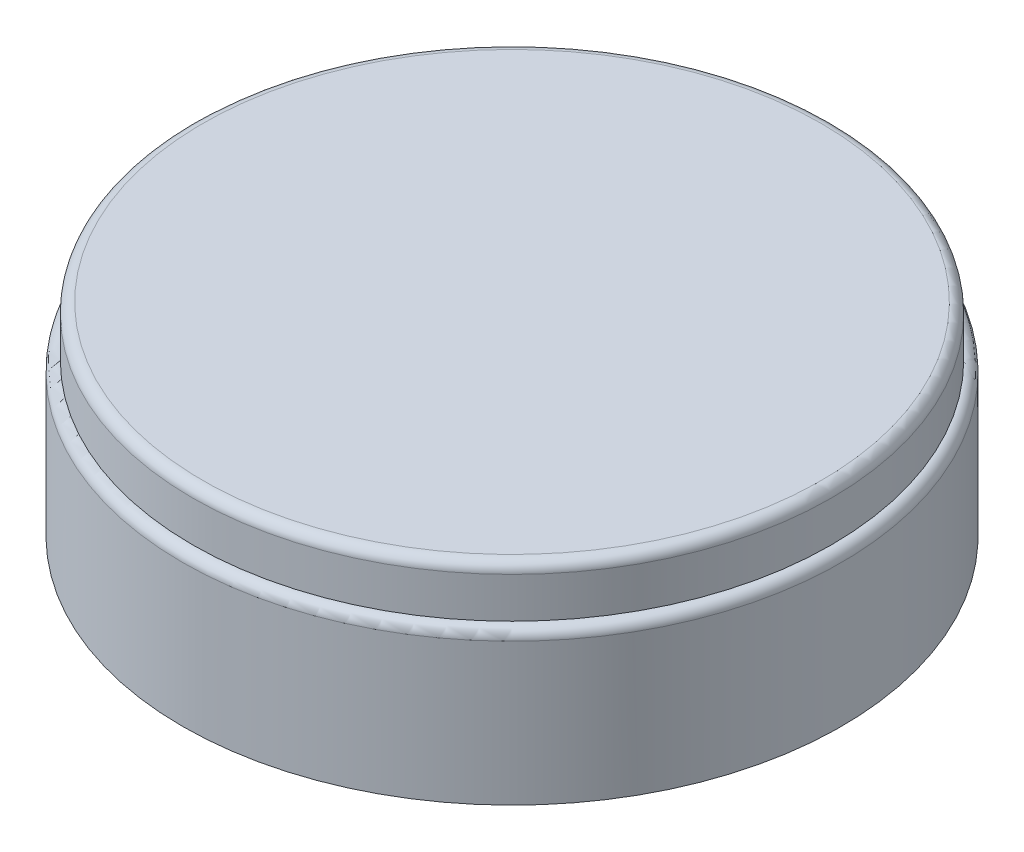
ISO-10303-21;
HEADER;
FILE_DESCRIPTION(('STEP AP214'),'2;1');
FILE_NAME('part.step','',(''),(''),'','','');
FILE_SCHEMA(('AUTOMOTIVE_DESIGN { 1 0 10303 214 1 1 1 1 }'));
ENDSEC;
DATA;
#1=APPLICATION_CONTEXT('core data for automotive mechanical design processes');
#2=APPLICATION_PROTOCOL_DEFINITION('international standard','automotive_design',2000,#1);
#3=PRODUCT_CONTEXT('',#1,'mechanical');
#4=PRODUCT('Part','Part','',(#3));
#5=PRODUCT_RELATED_PRODUCT_CATEGORY('part','',(#4));
#6=PRODUCT_DEFINITION_FORMATION('','',#4);
#7=PRODUCT_DEFINITION_CONTEXT('part definition',#1,'design');
#8=PRODUCT_DEFINITION('design','',#6,#7);
#9=PRODUCT_DEFINITION_SHAPE('','',#8);
#10=(LENGTH_UNIT() NAMED_UNIT(*) SI_UNIT(.MILLI.,.METRE.));
#11=(NAMED_UNIT(*) PLANE_ANGLE_UNIT() SI_UNIT($,.RADIAN.));
#12=(NAMED_UNIT(*) SI_UNIT($,.STERADIAN.) SOLID_ANGLE_UNIT());
#13=UNCERTAINTY_MEASURE_WITH_UNIT(LENGTH_MEASURE(1.E-05),#10,'distance_accuracy_value','');
#14=(GEOMETRIC_REPRESENTATION_CONTEXT(3) GLOBAL_UNCERTAINTY_ASSIGNED_CONTEXT((#13)) GLOBAL_UNIT_ASSIGNED_CONTEXT((#10,
#11,#12)) REPRESENTATION_CONTEXT('',''));
#15=CARTESIAN_POINT('',(0.,0.,0.));
#16=DIRECTION('',(0.,0.,1.));
#17=DIRECTION('',(1.,0.,0.));
#18=AXIS2_PLACEMENT_3D('',#15,#16,#17);
#19=CARTESIAN_POINT('',(0.,0.,0.));
#20=DIRECTION('',(0.,1.,0.));
#21=DIRECTION('',(0.,0.,1.));
#22=AXIS2_PLACEMENT_3D('',#19,#20,#21);
#23=PLANE('',#22);
#24=CARTESIAN_POINT('',(0.,0.,0.));
#25=DIRECTION('',(0.,1.,0.));
#26=DIRECTION('',(0.,0.,1.));
#27=AXIS2_PLACEMENT_3D('',#24,#25,#26);
#28=CIRCLE('',#27,30.5);
#29=CARTESIAN_POINT('',(0.,0.,30.5));
#30=VERTEX_POINT('',#29);
#31=EDGE_CURVE('E57',#30,#30,#28,.T.);
#32=ORIENTED_EDGE('',*,*,#31,.T.);
#33=EDGE_LOOP('',(#32));
#34=FACE_BOUND('',#33,.T.);
#35=CARTESIAN_POINT('',(0.,0.,0.));
#36=DIRECTION('',(0.,1.,0.));
#37=DIRECTION('',(0.,0.,1.));
#38=AXIS2_PLACEMENT_3D('',#35,#36,#37);
#39=CIRCLE('',#38,32.5);
#40=CARTESIAN_POINT('',(0.,0.,32.5));
#41=VERTEX_POINT('',#40);
#42=EDGE_CURVE('E48',#41,#41,#39,.T.);
#43=ORIENTED_EDGE('',*,*,#42,.F.);
#44=EDGE_LOOP('',(#43));
#45=FACE_BOUND('',#44,.T.);
#46=ADVANCED_FACE('F33',(#34,#45),#23,.F.);
#47=CARTESIAN_POINT('',(0.,0.,0.));
#48=DIRECTION('',(0.,1.,0.));
#49=DIRECTION('',(0.,0.,1.));
#50=AXIS2_PLACEMENT_3D('',#47,#48,#49);
#51=CYLINDRICAL_SURFACE('',#50,32.5);
#52=CARTESIAN_POINT('',(0.,14.,0.));
#53=DIRECTION('',(0.,-1.,0.));
#54=DIRECTION('',(0.,0.,-1.));
#55=AXIS2_PLACEMENT_3D('',#52,#53,#54);
#56=CIRCLE('',#55,32.5);
#57=CARTESIAN_POINT('',(0.,14.,-32.5));
#58=VERTEX_POINT('',#57);
#59=EDGE_CURVE('E10',#58,#58,#56,.T.);
#60=ORIENTED_EDGE('',*,*,#59,.T.);
#61=EDGE_LOOP('',(#60));
#62=FACE_BOUND('',#61,.T.);
#63=ORIENTED_EDGE('',*,*,#42,.T.);
#64=EDGE_LOOP('',(#63));
#65=FACE_BOUND('',#64,.T.);
#66=ADVANCED_FACE('F75',(#62,#65),#51,.T.);
#67=CARTESIAN_POINT('',(0.,0.,0.));
#68=DIRECTION('',(0.,1.,0.));
#69=DIRECTION('',(0.,0.,1.));
#70=AXIS2_PLACEMENT_3D('',#67,#68,#69);
#71=CYLINDRICAL_SURFACE('',#70,31.5);
#72=CARTESIAN_POINT('',(0.,19.,0.));
#73=DIRECTION('',(0.,-1.,0.));
#74=DIRECTION('',(0.,0.,-1.));
#75=AXIS2_PLACEMENT_3D('',#72,#73,#74);
#76=CIRCLE('',#75,31.5);
#77=CARTESIAN_POINT('',(0.,19.,-31.5));
#78=VERTEX_POINT('',#77);
#79=EDGE_CURVE('E40',#78,#78,#76,.T.);
#80=ORIENTED_EDGE('',*,*,#79,.T.);
#81=EDGE_LOOP('',(#80));
#82=FACE_BOUND('',#81,.T.);
#83=CARTESIAN_POINT('',(0.,15.,0.));
#84=DIRECTION('',(0.,1.,0.));
#85=DIRECTION('',(0.,0.,1.));
#86=AXIS2_PLACEMENT_3D('',#83,#84,#85);
#87=CIRCLE('',#86,31.5);
#88=CARTESIAN_POINT('',(0.,15.,31.5));
#89=VERTEX_POINT('',#88);
#90=EDGE_CURVE('E53',#89,#89,#87,.T.);
#91=ORIENTED_EDGE('',*,*,#90,.T.);
#92=EDGE_LOOP('',(#91));
#93=FACE_BOUND('',#92,.T.);
#94=ADVANCED_FACE('F81',(#82,#93),#71,.T.);
#95=CARTESIAN_POINT('',(0.,20.,0.));
#96=DIRECTION('',(0.,-1.,0.));
#97=DIRECTION('',(0.,0.,-1.));
#98=AXIS2_PLACEMENT_3D('',#95,#96,#97);
#99=PLANE('',#98);
#100=CARTESIAN_POINT('',(0.,20.,0.));
#101=DIRECTION('',(0.,-1.,0.));
#102=DIRECTION('',(0.,0.,-1.));
#103=AXIS2_PLACEMENT_3D('',#100,#101,#102);
#104=CIRCLE('',#103,30.5);
#105=CARTESIAN_POINT('',(0.,20.,-30.5));
#106=VERTEX_POINT('',#105);
#107=EDGE_CURVE('E44',#106,#106,#104,.F.);
#108=ORIENTED_EDGE('',*,*,#107,.T.);
#109=EDGE_LOOP('',(#108));
#110=FACE_BOUND('',#109,.T.);
#111=ADVANCED_FACE('F87',(#110),#99,.F.);
#112=CARTESIAN_POINT('',(0.,19.,0.));
#113=DIRECTION('',(0.,-1.,0.));
#114=DIRECTION('',(0.,0.,-1.));
#115=AXIS2_PLACEMENT_3D('',#112,#113,#114);
#116=TOROIDAL_SURFACE('',#115,30.5,1.);
#117=ORIENTED_EDGE('',*,*,#79,.F.);
#118=EDGE_LOOP('',(#117));
#119=FACE_BOUND('',#118,.T.);
#120=ORIENTED_EDGE('',*,*,#107,.F.);
#121=EDGE_LOOP('',(#120));
#122=FACE_BOUND('',#121,.T.);
#123=ADVANCED_FACE('F85',(#119,#122),#116,.T.);
#124=CARTESIAN_POINT('',(0.,14.,0.));
#125=DIRECTION('',(0.,-1.,0.));
#126=DIRECTION('',(0.,0.,-1.));
#127=AXIS2_PLACEMENT_3D('',#124,#125,#126);
#128=TOROIDAL_SURFACE('',#127,31.5,1.);
#129=ORIENTED_EDGE('',*,*,#59,.F.);
#130=EDGE_LOOP('',(#129));
#131=FACE_BOUND('',#130,.T.);
#132=ORIENTED_EDGE('',*,*,#90,.F.);
#133=EDGE_LOOP('',(#132));
#134=FACE_BOUND('',#133,.T.);
#135=ADVANCED_FACE('F35',(#131,#134),#128,.T.);
#136=CARTESIAN_POINT('',(0.,0.,0.));
#137=DIRECTION('',(0.,1.,0.));
#138=DIRECTION('',(0.,0.,1.));
#139=AXIS2_PLACEMENT_3D('',#136,#137,#138);
#140=CYLINDRICAL_SURFACE('',#139,30.5);
#141=CARTESIAN_POINT('',(0.,19.,0.));
#142=DIRECTION('',(0.,-1.,0.));
#143=DIRECTION('',(0.,0.,-1.));
#144=AXIS2_PLACEMENT_3D('',#141,#142,#143);
#145=CIRCLE('',#144,30.5);
#146=CARTESIAN_POINT('',(0.,19.,-30.5));
#147=VERTEX_POINT('',#146);
#148=EDGE_CURVE('E56',#147,#147,#145,.F.);
#149=ORIENTED_EDGE('',*,*,#148,.T.);
#150=EDGE_LOOP('',(#149));
#151=FACE_BOUND('',#150,.T.);
#152=ORIENTED_EDGE('',*,*,#31,.F.);
#153=EDGE_LOOP('',(#152));
#154=FACE_BOUND('',#153,.T.);
#155=ADVANCED_FACE('F63',(#151,#154),#140,.F.);
#156=CARTESIAN_POINT('',(0.,19.,0.));
#157=DIRECTION('',(0.,-1.,0.));
#158=DIRECTION('',(0.,0.,-1.));
#159=AXIS2_PLACEMENT_3D('',#156,#157,#158);
#160=PLANE('',#159);
#161=ORIENTED_EDGE('',*,*,#148,.F.);
#162=EDGE_LOOP('',(#161));
#163=FACE_BOUND('',#162,.T.);
#164=ADVANCED_FACE('F66',(#163),#160,.T.);
#165=CLOSED_SHELL('',(#46,#66,#94,#111,#123,#135,#155,#164));
#166=MANIFOLD_SOLID_BREP('B2',#165);
#167=ADVANCED_BREP_SHAPE_REPRESENTATION('',(#18,#166),#14);
#168=SHAPE_DEFINITION_REPRESENTATION(#9,#167);
ENDSEC;
END-ISO-10303-21;
